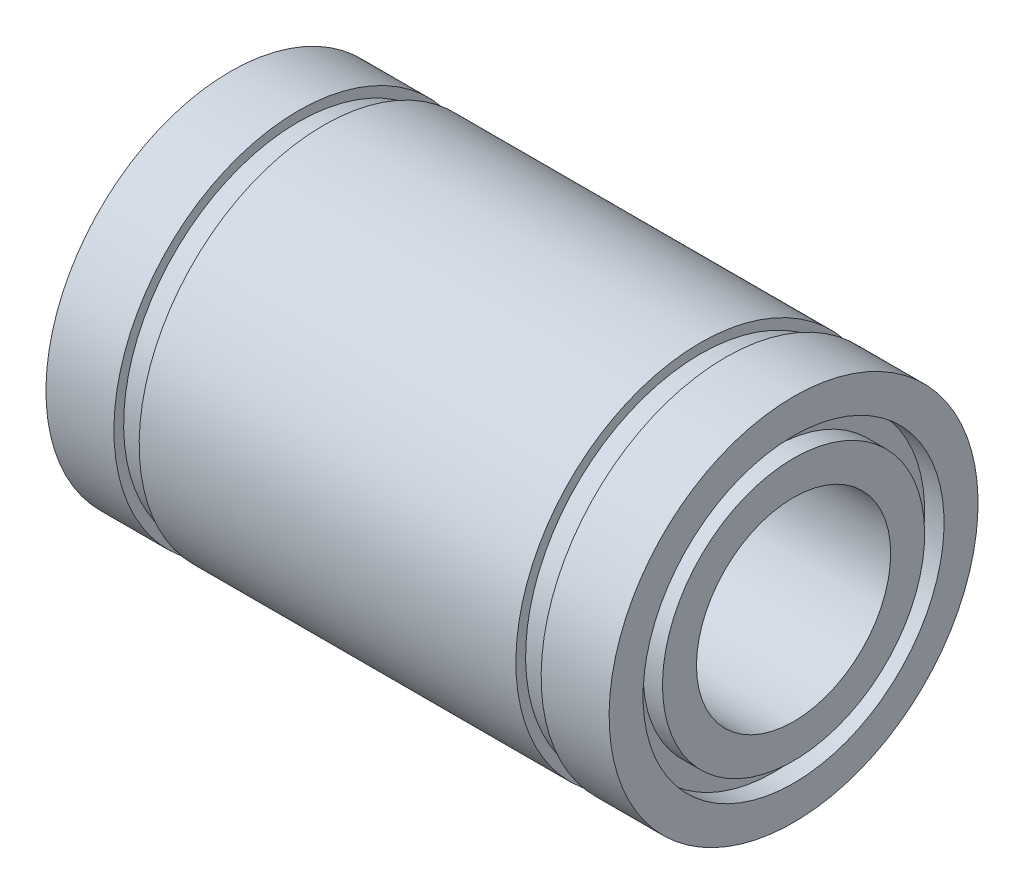
ISO-10303-21;
HEADER;
FILE_DESCRIPTION(('STEP AP214'),'2;1');
FILE_NAME('part.step','',(''),(''),'','','');
FILE_SCHEMA(('AUTOMOTIVE_DESIGN { 1 0 10303 214 1 1 1 1 }'));
ENDSEC;
DATA;
#1=APPLICATION_CONTEXT('core data for automotive mechanical design processes');
#2=APPLICATION_PROTOCOL_DEFINITION('international standard','automotive_design',2000,#1);
#3=PRODUCT_CONTEXT('',#1,'mechanical');
#4=PRODUCT('Part','Part','',(#3));
#5=PRODUCT_RELATED_PRODUCT_CATEGORY('part','',(#4));
#6=PRODUCT_DEFINITION_FORMATION('','',#4);
#7=PRODUCT_DEFINITION_CONTEXT('part definition',#1,'design');
#8=PRODUCT_DEFINITION('design','',#6,#7);
#9=PRODUCT_DEFINITION_SHAPE('','',#8);
#10=(LENGTH_UNIT() NAMED_UNIT(*) SI_UNIT(.MILLI.,.METRE.));
#11=(NAMED_UNIT(*) PLANE_ANGLE_UNIT() SI_UNIT($,.RADIAN.));
#12=(NAMED_UNIT(*) SI_UNIT($,.STERADIAN.) SOLID_ANGLE_UNIT());
#13=UNCERTAINTY_MEASURE_WITH_UNIT(LENGTH_MEASURE(1.E-05),#10,'distance_accuracy_value','');
#14=(GEOMETRIC_REPRESENTATION_CONTEXT(3) GLOBAL_UNCERTAINTY_ASSIGNED_CONTEXT((#13)) GLOBAL_UNIT_ASSIGNED_CONTEXT((#10,
#11,#12)) REPRESENTATION_CONTEXT('',''));
#15=CARTESIAN_POINT('',(0.,0.,0.));
#16=DIRECTION('',(0.,0.,1.));
#17=DIRECTION('',(1.,0.,0.));
#18=AXIS2_PLACEMENT_3D('',#15,#16,#17);
#19=CARTESIAN_POINT('',(-14.5,7.75,0.));
#20=DIRECTION('',(-1.,0.,0.));
#21=DIRECTION('',(0.,-1.,0.));
#22=AXIS2_PLACEMENT_3D('',#19,#20,#21);
#23=PLANE('',#22);
#24=CARTESIAN_POINT('',(-14.5,0.,0.));
#25=DIRECTION('',(1.,0.,0.));
#26=DIRECTION('',(0.,1.,0.));
#27=AXIS2_PLACEMENT_3D('',#24,#25,#26);
#28=CIRCLE('',#27,7.75);
#29=CARTESIAN_POINT('',(-14.5,7.75,0.));
#30=VERTEX_POINT('',#29);
#31=EDGE_CURVE('E121',#30,#30,#28,.T.);
#32=ORIENTED_EDGE('',*,*,#31,.T.);
#33=EDGE_LOOP('',(#32));
#34=FACE_BOUND('',#33,.T.);
#35=CARTESIAN_POINT('',(-14.5,0.,0.));
#36=DIRECTION('',(1.,0.,0.));
#37=DIRECTION('',(0.,1.,0.));
#38=AXIS2_PLACEMENT_3D('',#35,#36,#37);
#39=CIRCLE('',#38,9.5);
#40=CARTESIAN_POINT('',(-14.5,9.5,0.));
#41=VERTEX_POINT('',#40);
#42=EDGE_CURVE('E10',#41,#41,#39,.T.);
#43=ORIENTED_EDGE('',*,*,#42,.F.);
#44=EDGE_LOOP('',(#43));
#45=FACE_BOUND('',#44,.T.);
#46=ADVANCED_FACE('F38',(#34,#45),#23,.T.);
#47=CARTESIAN_POINT('',(0.,0.,0.));
#48=DIRECTION('',(1.,0.,0.));
#49=DIRECTION('',(0.,1.,0.));
#50=AXIS2_PLACEMENT_3D('',#47,#48,#49);
#51=CYLINDRICAL_SURFACE('',#50,9.5);
#52=ORIENTED_EDGE('',*,*,#42,.T.);
#53=EDGE_LOOP('',(#52));
#54=FACE_BOUND('',#53,.T.);
#55=CARTESIAN_POINT('',(-11.,0.,0.));
#56=DIRECTION('',(1.,0.,0.));
#57=DIRECTION('',(0.,1.,0.));
#58=AXIS2_PLACEMENT_3D('',#55,#56,#57);
#59=CIRCLE('',#58,9.5);
#60=CARTESIAN_POINT('',(-11.,9.5,0.));
#61=VERTEX_POINT('',#60);
#62=EDGE_CURVE('E45',#61,#61,#59,.T.);
#63=ORIENTED_EDGE('',*,*,#62,.F.);
#64=EDGE_LOOP('',(#63));
#65=FACE_BOUND('',#64,.T.);
#66=ADVANCED_FACE('F140',(#54,#65),#51,.T.);
#67=CARTESIAN_POINT('',(-11.,9.5,0.));
#68=DIRECTION('',(1.,0.,0.));
#69=DIRECTION('',(0.,1.,0.));
#70=AXIS2_PLACEMENT_3D('',#67,#68,#69);
#71=PLANE('',#70);
#72=ORIENTED_EDGE('',*,*,#62,.T.);
#73=EDGE_LOOP('',(#72));
#74=FACE_BOUND('',#73,.T.);
#75=CARTESIAN_POINT('',(-11.,0.,0.));
#76=DIRECTION('',(1.,0.,0.));
#77=DIRECTION('',(0.,1.,0.));
#78=AXIS2_PLACEMENT_3D('',#75,#76,#77);
#79=CIRCLE('',#78,9.);
#80=CARTESIAN_POINT('',(-11.,9.,0.));
#81=VERTEX_POINT('',#80);
#82=EDGE_CURVE('E52',#81,#81,#79,.T.);
#83=ORIENTED_EDGE('',*,*,#82,.F.);
#84=EDGE_LOOP('',(#83));
#85=FACE_BOUND('',#84,.T.);
#86=ADVANCED_FACE('F144',(#74,#85),#71,.T.);
#87=CARTESIAN_POINT('',(0.,0.,0.));
#88=DIRECTION('',(1.,0.,0.));
#89=DIRECTION('',(0.,1.,0.));
#90=AXIS2_PLACEMENT_3D('',#87,#88,#89);
#91=CYLINDRICAL_SURFACE('',#90,9.);
#92=ORIENTED_EDGE('',*,*,#82,.T.);
#93=EDGE_LOOP('',(#92));
#94=FACE_BOUND('',#93,.T.);
#95=CARTESIAN_POINT('',(-9.7,0.,0.));
#96=DIRECTION('',(1.,0.,0.));
#97=DIRECTION('',(0.,1.,0.));
#98=AXIS2_PLACEMENT_3D('',#95,#96,#97);
#99=CIRCLE('',#98,9.);
#100=CARTESIAN_POINT('',(-9.7,9.,0.));
#101=VERTEX_POINT('',#100);
#102=EDGE_CURVE('E58',#101,#101,#99,.T.);
#103=ORIENTED_EDGE('',*,*,#102,.F.);
#104=EDGE_LOOP('',(#103));
#105=FACE_BOUND('',#104,.T.);
#106=ADVANCED_FACE('F148',(#94,#105),#91,.T.);
#107=CARTESIAN_POINT('',(-9.7,9.,0.));
#108=DIRECTION('',(-1.,0.,0.));
#109=DIRECTION('',(0.,-1.,0.));
#110=AXIS2_PLACEMENT_3D('',#107,#108,#109);
#111=PLANE('',#110);
#112=ORIENTED_EDGE('',*,*,#102,.T.);
#113=EDGE_LOOP('',(#112));
#114=FACE_BOUND('',#113,.T.);
#115=CARTESIAN_POINT('',(-9.7,0.,0.));
#116=DIRECTION('',(1.,0.,0.));
#117=DIRECTION('',(0.,1.,0.));
#118=AXIS2_PLACEMENT_3D('',#115,#116,#117);
#119=CIRCLE('',#118,9.5);
#120=CARTESIAN_POINT('',(-9.7,9.5,0.));
#121=VERTEX_POINT('',#120);
#122=EDGE_CURVE('E64',#121,#121,#119,.T.);
#123=ORIENTED_EDGE('',*,*,#122,.F.);
#124=EDGE_LOOP('',(#123));
#125=FACE_BOUND('',#124,.T.);
#126=ADVANCED_FACE('F154',(#114,#125),#111,.T.);
#127=CARTESIAN_POINT('',(0.,0.,0.));
#128=DIRECTION('',(1.,0.,0.));
#129=DIRECTION('',(0.,1.,0.));
#130=AXIS2_PLACEMENT_3D('',#127,#128,#129);
#131=CYLINDRICAL_SURFACE('',#130,9.5);
#132=ORIENTED_EDGE('',*,*,#122,.T.);
#133=EDGE_LOOP('',(#132));
#134=FACE_BOUND('',#133,.T.);
#135=CARTESIAN_POINT('',(9.7,0.,0.));
#136=DIRECTION('',(1.,0.,0.));
#137=DIRECTION('',(0.,1.,0.));
#138=AXIS2_PLACEMENT_3D('',#135,#136,#137);
#139=CIRCLE('',#138,9.5);
#140=CARTESIAN_POINT('',(9.7,9.5,0.));
#141=VERTEX_POINT('',#140);
#142=EDGE_CURVE('E67',#141,#141,#139,.T.);
#143=ORIENTED_EDGE('',*,*,#142,.F.);
#144=EDGE_LOOP('',(#143));
#145=FACE_BOUND('',#144,.T.);
#146=ADVANCED_FACE('F158',(#134,#145),#131,.T.);
#147=CARTESIAN_POINT('',(9.7,9.5,0.));
#148=DIRECTION('',(1.,0.,0.));
#149=DIRECTION('',(0.,1.,0.));
#150=AXIS2_PLACEMENT_3D('',#147,#148,#149);
#151=PLANE('',#150);
#152=ORIENTED_EDGE('',*,*,#142,.T.);
#153=EDGE_LOOP('',(#152));
#154=FACE_BOUND('',#153,.T.);
#155=CARTESIAN_POINT('',(9.7,0.,0.));
#156=DIRECTION('',(1.,0.,0.));
#157=DIRECTION('',(0.,1.,0.));
#158=AXIS2_PLACEMENT_3D('',#155,#156,#157);
#159=CIRCLE('',#158,9.);
#160=CARTESIAN_POINT('',(9.7,9.,0.));
#161=VERTEX_POINT('',#160);
#162=EDGE_CURVE('E70',#161,#161,#159,.T.);
#163=ORIENTED_EDGE('',*,*,#162,.F.);
#164=EDGE_LOOP('',(#163));
#165=FACE_BOUND('',#164,.T.);
#166=ADVANCED_FACE('F162',(#154,#165),#151,.T.);
#167=CARTESIAN_POINT('',(0.,0.,0.));
#168=DIRECTION('',(1.,0.,0.));
#169=DIRECTION('',(0.,1.,0.));
#170=AXIS2_PLACEMENT_3D('',#167,#168,#169);
#171=CYLINDRICAL_SURFACE('',#170,9.);
#172=ORIENTED_EDGE('',*,*,#162,.T.);
#173=EDGE_LOOP('',(#172));
#174=FACE_BOUND('',#173,.T.);
#175=CARTESIAN_POINT('',(11.,0.,0.));
#176=DIRECTION('',(1.,0.,0.));
#177=DIRECTION('',(0.,1.,0.));
#178=AXIS2_PLACEMENT_3D('',#175,#176,#177);
#179=CIRCLE('',#178,9.);
#180=CARTESIAN_POINT('',(11.,9.,0.));
#181=VERTEX_POINT('',#180);
#182=EDGE_CURVE('E74',#181,#181,#179,.T.);
#183=ORIENTED_EDGE('',*,*,#182,.F.);
#184=EDGE_LOOP('',(#183));
#185=FACE_BOUND('',#184,.T.);
#186=ADVANCED_FACE('F166',(#174,#185),#171,.T.);
#187=CARTESIAN_POINT('',(11.,9.,0.));
#188=DIRECTION('',(-1.,0.,0.));
#189=DIRECTION('',(0.,-1.,0.));
#190=AXIS2_PLACEMENT_3D('',#187,#188,#189);
#191=PLANE('',#190);
#192=ORIENTED_EDGE('',*,*,#182,.T.);
#193=EDGE_LOOP('',(#192));
#194=FACE_BOUND('',#193,.T.);
#195=CARTESIAN_POINT('',(11.,0.,0.));
#196=DIRECTION('',(1.,0.,0.));
#197=DIRECTION('',(0.,1.,0.));
#198=AXIS2_PLACEMENT_3D('',#195,#196,#197);
#199=CIRCLE('',#198,9.5);
#200=CARTESIAN_POINT('',(11.,9.5,0.));
#201=VERTEX_POINT('',#200);
#202=EDGE_CURVE('E78',#201,#201,#199,.T.);
#203=ORIENTED_EDGE('',*,*,#202,.F.);
#204=EDGE_LOOP('',(#203));
#205=FACE_BOUND('',#204,.T.);
#206=ADVANCED_FACE('F170',(#194,#205),#191,.T.);
#207=CARTESIAN_POINT('',(0.,0.,0.));
#208=DIRECTION('',(1.,0.,0.));
#209=DIRECTION('',(0.,1.,0.));
#210=AXIS2_PLACEMENT_3D('',#207,#208,#209);
#211=CYLINDRICAL_SURFACE('',#210,9.49999999999999);
#212=ORIENTED_EDGE('',*,*,#202,.T.);
#213=EDGE_LOOP('',(#212));
#214=FACE_BOUND('',#213,.T.);
#215=CARTESIAN_POINT('',(14.5,0.,0.));
#216=DIRECTION('',(1.,0.,0.));
#217=DIRECTION('',(0.,1.,0.));
#218=AXIS2_PLACEMENT_3D('',#215,#216,#217);
#219=CIRCLE('',#218,9.49999999999999);
#220=CARTESIAN_POINT('',(14.5,9.49999999999999,0.));
#221=VERTEX_POINT('',#220);
#222=EDGE_CURVE('E82',#221,#221,#219,.T.);
#223=ORIENTED_EDGE('',*,*,#222,.F.);
#224=EDGE_LOOP('',(#223));
#225=FACE_BOUND('',#224,.T.);
#226=ADVANCED_FACE('F174',(#214,#225),#211,.T.);
#227=CARTESIAN_POINT('',(14.5,9.49999999999999,0.));
#228=DIRECTION('',(1.,0.,0.));
#229=DIRECTION('',(0.,1.,0.));
#230=AXIS2_PLACEMENT_3D('',#227,#228,#229);
#231=PLANE('',#230);
#232=ORIENTED_EDGE('',*,*,#222,.T.);
#233=EDGE_LOOP('',(#232));
#234=FACE_BOUND('',#233,.T.);
#235=CARTESIAN_POINT('',(14.5,0.,0.));
#236=DIRECTION('',(1.,0.,0.));
#237=DIRECTION('',(0.,1.,0.));
#238=AXIS2_PLACEMENT_3D('',#235,#236,#237);
#239=CIRCLE('',#238,7.74999999999999);
#240=CARTESIAN_POINT('',(14.5,7.74999999999999,0.));
#241=VERTEX_POINT('',#240);
#242=EDGE_CURVE('E86',#241,#241,#239,.T.);
#243=ORIENTED_EDGE('',*,*,#242,.F.);
#244=EDGE_LOOP('',(#243));
#245=FACE_BOUND('',#244,.T.);
#246=ADVANCED_FACE('F178',(#234,#245),#231,.T.);
#247=CARTESIAN_POINT('',(0.,0.,0.));
#248=DIRECTION('',(1.,0.,0.));
#249=DIRECTION('',(0.,1.,0.));
#250=AXIS2_PLACEMENT_3D('',#247,#248,#249);
#251=CYLINDRICAL_SURFACE('',#250,7.74999999999999);
#252=ORIENTED_EDGE('',*,*,#242,.T.);
#253=EDGE_LOOP('',(#252));
#254=FACE_BOUND('',#253,.T.);
#255=CARTESIAN_POINT('',(13.5,0.,0.));
#256=DIRECTION('',(1.,0.,0.));
#257=DIRECTION('',(0.,1.,0.));
#258=AXIS2_PLACEMENT_3D('',#255,#256,#257);
#259=CIRCLE('',#258,7.74999999999999);
#260=CARTESIAN_POINT('',(13.5,7.74999999999999,0.));
#261=VERTEX_POINT('',#260);
#262=EDGE_CURVE('E90',#261,#261,#259,.T.);
#263=ORIENTED_EDGE('',*,*,#262,.F.);
#264=EDGE_LOOP('',(#263));
#265=FACE_BOUND('',#264,.T.);
#266=ADVANCED_FACE('F182',(#254,#265),#251,.F.);
#267=CARTESIAN_POINT('',(13.5,7.74999999999999,0.));
#268=DIRECTION('',(1.,0.,0.));
#269=DIRECTION('',(0.,1.,0.));
#270=AXIS2_PLACEMENT_3D('',#267,#268,#269);
#271=PLANE('',#270);
#272=ORIENTED_EDGE('',*,*,#262,.T.);
#273=EDGE_LOOP('',(#272));
#274=FACE_BOUND('',#273,.T.);
#275=CARTESIAN_POINT('',(13.5,0.,0.));
#276=DIRECTION('',(1.,0.,0.));
#277=DIRECTION('',(0.,1.,0.));
#278=AXIS2_PLACEMENT_3D('',#275,#276,#277);
#279=CIRCLE('',#278,6.74999999999999);
#280=CARTESIAN_POINT('',(13.5,6.75,0.));
#281=VERTEX_POINT('',#280);
#282=EDGE_CURVE('E94',#281,#281,#279,.T.);
#283=ORIENTED_EDGE('',*,*,#282,.F.);
#284=EDGE_LOOP('',(#283));
#285=FACE_BOUND('',#284,.T.);
#286=ADVANCED_FACE('F186',(#274,#285),#271,.T.);
#287=CARTESIAN_POINT('',(0.,0.,0.));
#288=DIRECTION('',(1.,0.,0.));
#289=DIRECTION('',(0.,1.,0.));
#290=AXIS2_PLACEMENT_3D('',#287,#288,#289);
#291=CYLINDRICAL_SURFACE('',#290,6.74999999999999);
#292=ORIENTED_EDGE('',*,*,#282,.T.);
#293=EDGE_LOOP('',(#292));
#294=FACE_BOUND('',#293,.T.);
#295=CARTESIAN_POINT('',(14.5,0.,0.));
#296=DIRECTION('',(1.,0.,0.));
#297=DIRECTION('',(0.,1.,0.));
#298=AXIS2_PLACEMENT_3D('',#295,#296,#297);
#299=CIRCLE('',#298,6.74999999999999);
#300=CARTESIAN_POINT('',(14.5,6.75,0.));
#301=VERTEX_POINT('',#300);
#302=EDGE_CURVE('E98',#301,#301,#299,.T.);
#303=ORIENTED_EDGE('',*,*,#302,.F.);
#304=EDGE_LOOP('',(#303));
#305=FACE_BOUND('',#304,.T.);
#306=ADVANCED_FACE('F190',(#294,#305),#291,.T.);
#307=CARTESIAN_POINT('',(14.5,6.75,0.));
#308=DIRECTION('',(1.,0.,0.));
#309=DIRECTION('',(0.,1.,0.));
#310=AXIS2_PLACEMENT_3D('',#307,#308,#309);
#311=PLANE('',#310);
#312=ORIENTED_EDGE('',*,*,#302,.T.);
#313=EDGE_LOOP('',(#312));
#314=FACE_BOUND('',#313,.T.);
#315=CARTESIAN_POINT('',(14.5,0.,0.));
#316=DIRECTION('',(1.,0.,0.));
#317=DIRECTION('',(0.,1.,0.));
#318=AXIS2_PLACEMENT_3D('',#315,#316,#317);
#319=CIRCLE('',#318,5.);
#320=CARTESIAN_POINT('',(14.5,5.,0.));
#321=VERTEX_POINT('',#320);
#322=EDGE_CURVE('E102',#321,#321,#319,.T.);
#323=ORIENTED_EDGE('',*,*,#322,.F.);
#324=EDGE_LOOP('',(#323));
#325=FACE_BOUND('',#324,.T.);
#326=ADVANCED_FACE('F194',(#314,#325),#311,.T.);
#327=CARTESIAN_POINT('',(0.,0.,0.));
#328=DIRECTION('',(1.,0.,0.));
#329=DIRECTION('',(0.,1.,0.));
#330=AXIS2_PLACEMENT_3D('',#327,#328,#329);
#331=CYLINDRICAL_SURFACE('',#330,5.);
#332=ORIENTED_EDGE('',*,*,#322,.T.);
#333=EDGE_LOOP('',(#332));
#334=FACE_BOUND('',#333,.T.);
#335=CARTESIAN_POINT('',(-14.5,0.,0.));
#336=DIRECTION('',(1.,0.,0.));
#337=DIRECTION('',(0.,1.,0.));
#338=AXIS2_PLACEMENT_3D('',#335,#336,#337);
#339=CIRCLE('',#338,5.);
#340=CARTESIAN_POINT('',(-14.5,5.,0.));
#341=VERTEX_POINT('',#340);
#342=EDGE_CURVE('E105',#341,#341,#339,.T.);
#343=ORIENTED_EDGE('',*,*,#342,.F.);
#344=EDGE_LOOP('',(#343));
#345=FACE_BOUND('',#344,.T.);
#346=ADVANCED_FACE('F198',(#334,#345),#331,.F.);
#347=CARTESIAN_POINT('',(-14.5,5.,0.));
#348=DIRECTION('',(-1.,0.,0.));
#349=DIRECTION('',(0.,-1.,0.));
#350=AXIS2_PLACEMENT_3D('',#347,#348,#349);
#351=PLANE('',#350);
#352=ORIENTED_EDGE('',*,*,#342,.T.);
#353=EDGE_LOOP('',(#352));
#354=FACE_BOUND('',#353,.T.);
#355=CARTESIAN_POINT('',(-14.5,0.,0.));
#356=DIRECTION('',(1.,0.,0.));
#357=DIRECTION('',(0.,1.,0.));
#358=AXIS2_PLACEMENT_3D('',#355,#356,#357);
#359=CIRCLE('',#358,6.75);
#360=CARTESIAN_POINT('',(-14.5,6.75,0.));
#361=VERTEX_POINT('',#360);
#362=EDGE_CURVE('E109',#361,#361,#359,.T.);
#363=ORIENTED_EDGE('',*,*,#362,.F.);
#364=EDGE_LOOP('',(#363));
#365=FACE_BOUND('',#364,.T.);
#366=ADVANCED_FACE('F202',(#354,#365),#351,.T.);
#367=CARTESIAN_POINT('',(0.,0.,0.));
#368=DIRECTION('',(1.,0.,0.));
#369=DIRECTION('',(0.,1.,0.));
#370=AXIS2_PLACEMENT_3D('',#367,#368,#369);
#371=CYLINDRICAL_SURFACE('',#370,6.75);
#372=ORIENTED_EDGE('',*,*,#362,.T.);
#373=EDGE_LOOP('',(#372));
#374=FACE_BOUND('',#373,.T.);
#375=CARTESIAN_POINT('',(-13.5,0.,0.));
#376=DIRECTION('',(1.,0.,0.));
#377=DIRECTION('',(0.,1.,0.));
#378=AXIS2_PLACEMENT_3D('',#375,#376,#377);
#379=CIRCLE('',#378,6.75);
#380=CARTESIAN_POINT('',(-13.5,6.75,0.));
#381=VERTEX_POINT('',#380);
#382=EDGE_CURVE('E113',#381,#381,#379,.T.);
#383=ORIENTED_EDGE('',*,*,#382,.F.);
#384=EDGE_LOOP('',(#383));
#385=FACE_BOUND('',#384,.T.);
#386=ADVANCED_FACE('F136',(#374,#385),#371,.T.);
#387=CARTESIAN_POINT('',(-13.5,7.75,0.));
#388=DIRECTION('',(-1.,0.,0.));
#389=DIRECTION('',(0.,-1.,0.));
#390=AXIS2_PLACEMENT_3D('',#387,#388,#389);
#391=PLANE('',#390);
#392=ORIENTED_EDGE('',*,*,#382,.T.);
#393=EDGE_LOOP('',(#392));
#394=FACE_BOUND('',#393,.T.);
#395=CARTESIAN_POINT('',(-13.5,0.,0.));
#396=DIRECTION('',(1.,0.,0.));
#397=DIRECTION('',(0.,1.,0.));
#398=AXIS2_PLACEMENT_3D('',#395,#396,#397);
#399=CIRCLE('',#398,7.75);
#400=CARTESIAN_POINT('',(-13.5,7.75,0.));
#401=VERTEX_POINT('',#400);
#402=EDGE_CURVE('E117',#401,#401,#399,.T.);
#403=ORIENTED_EDGE('',*,*,#402,.F.);
#404=EDGE_LOOP('',(#403));
#405=FACE_BOUND('',#404,.T.);
#406=ADVANCED_FACE('F130',(#394,#405),#391,.T.);
#407=CARTESIAN_POINT('',(0.,0.,0.));
#408=DIRECTION('',(1.,0.,0.));
#409=DIRECTION('',(0.,1.,0.));
#410=AXIS2_PLACEMENT_3D('',#407,#408,#409);
#411=CYLINDRICAL_SURFACE('',#410,7.75);
#412=ORIENTED_EDGE('',*,*,#402,.T.);
#413=EDGE_LOOP('',(#412));
#414=FACE_BOUND('',#413,.T.);
#415=ORIENTED_EDGE('',*,*,#31,.F.);
#416=EDGE_LOOP('',(#415));
#417=FACE_BOUND('',#416,.T.);
#418=ADVANCED_FACE('F128',(#414,#417),#411,.F.);
#419=CLOSED_SHELL('',(#46,#66,#86,#106,#126,#146,#166,#186,#206,#226,#246,#266,#286,#306,#326,
#346,#366,#386,#406,#418));
#420=MANIFOLD_SOLID_BREP('B2',#419);
#421=ADVANCED_BREP_SHAPE_REPRESENTATION('',(#18,#420),#14);
#422=SHAPE_DEFINITION_REPRESENTATION(#9,#421);
ENDSEC;
END-ISO-10303-21;
